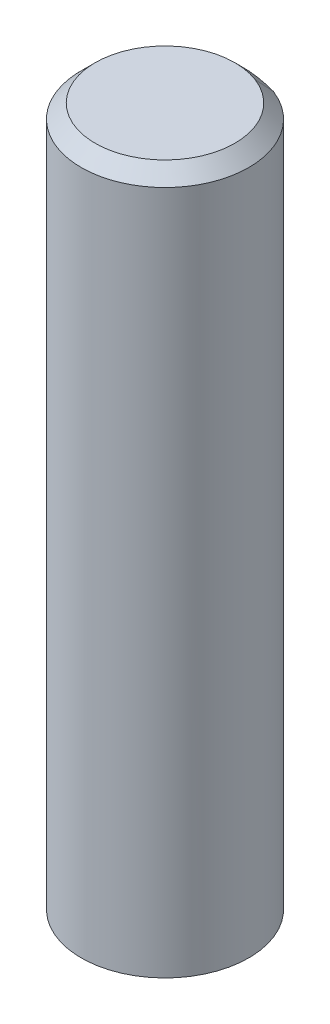
ISO-10303-21;
HEADER;
FILE_DESCRIPTION(('STEP AP214'),'2;1');
FILE_NAME('part.step','',(''),(''),'','','');
FILE_SCHEMA(('AUTOMOTIVE_DESIGN { 1 0 10303 214 1 1 1 1 }'));
ENDSEC;
DATA;
#1=APPLICATION_CONTEXT('core data for automotive mechanical design processes');
#2=APPLICATION_PROTOCOL_DEFINITION('international standard','automotive_design',2000,#1);
#3=PRODUCT_CONTEXT('',#1,'mechanical');
#4=PRODUCT('Part','Part','',(#3));
#5=PRODUCT_RELATED_PRODUCT_CATEGORY('part','',(#4));
#6=PRODUCT_DEFINITION_FORMATION('','',#4);
#7=PRODUCT_DEFINITION_CONTEXT('part definition',#1,'design');
#8=PRODUCT_DEFINITION('design','',#6,#7);
#9=PRODUCT_DEFINITION_SHAPE('','',#8);
#10=(LENGTH_UNIT() NAMED_UNIT(*) SI_UNIT(.MILLI.,.METRE.));
#11=(NAMED_UNIT(*) PLANE_ANGLE_UNIT() SI_UNIT($,.RADIAN.));
#12=(NAMED_UNIT(*) SI_UNIT($,.STERADIAN.) SOLID_ANGLE_UNIT());
#13=UNCERTAINTY_MEASURE_WITH_UNIT(LENGTH_MEASURE(1.E-05),#10,'distance_accuracy_value','');
#14=(GEOMETRIC_REPRESENTATION_CONTEXT(3) GLOBAL_UNCERTAINTY_ASSIGNED_CONTEXT((#13)) GLOBAL_UNIT_ASSIGNED_CONTEXT((#10,
#11,#12)) REPRESENTATION_CONTEXT('',''));
#15=CARTESIAN_POINT('',(0.,0.,0.));
#16=DIRECTION('',(0.,0.,1.));
#17=DIRECTION('',(1.,0.,0.));
#18=AXIS2_PLACEMENT_3D('',#15,#16,#17);
#19=CARTESIAN_POINT('',(0.,25.,0.));
#20=DIRECTION('',(0.,1.,0.));
#21=DIRECTION('',(0.,0.,1.));
#22=AXIS2_PLACEMENT_3D('',#19,#20,#21);
#23=PLANE('',#22);
#24=CARTESIAN_POINT('',(-4.41605694229922E-06,25.0000030573088,-2.31559280090398E-05));
#25=DIRECTION('',(0.,-1.,0.));
#26=DIRECTION('',(0.359014963110202,0.,-0.933331803949153));
#27=AXIS2_PLACEMENT_3D('',#24,#25,#26);
#28=CIRCLE('',#27,2.49999279933527);
#29=CARTESIAN_POINT('',(0.897528860195576,24.9999980865496,-2.33334181521173));
#30=VERTEX_POINT('',#29);
#31=CARTESIAN_POINT('',(-0.897543472307712,24.9999973786579,-2.33333651707424));
#32=VERTEX_POINT('',#31);
#33=EDGE_CURVE('E130',#30,#32,#28,.T.);
#34=ORIENTED_EDGE('',*,*,#33,.F.);
#35=CARTESIAN_POINT('',(3.96266032999439E-06,24.9999918798536,1.41741565208055E-06));
#36=DIRECTION('',(0.,-1.,0.));
#37=DIRECTION('',(-0.359017327837316,0.,-0.933330894330919));
#38=AXIS2_PLACEMENT_3D('',#35,#36,#37);
#39=CIRCLE('',#38,2.500005559707);
#40=EDGE_CURVE('E64',#32,#30,#39,.T.);
#41=ORIENTED_EDGE('',*,*,#40,.F.);
#42=EDGE_LOOP('',(#34,#41));
#43=FACE_BOUND('',#42,.T.);
#44=ADVANCED_FACE('F17',(#43),#23,.T.);
#45=CARTESIAN_POINT('',(3.96266032970383E-06,24.4970054045552,1.41741565208055E-06));
#46=DIRECTION('',(0.,-1.,0.));
#47=DIRECTION('',(1.,0.,0.));
#48=AXIS2_PLACEMENT_3D('',#45,#46,#47);
#49=CONICAL_SURFACE('',#48,3.00299594155375,0.785402046735676);
#50=ORIENTED_EDGE('',*,*,#40,.T.);
#51=CARTESIAN_POINT('',(1.0770315547767,24.5000172652965,-2.80000347708948));
#52=CARTESIAN_POINT('',(1.06955235910355,24.5208500066302,-2.78055940601546));
#53=CARTESIAN_POINT('',(1.06207316107593,24.5416827479638,-2.76111533584708));
#54=CARTESIAN_POINT('',(1.04711476031177,24.5833482306312,-2.72222719732165));
#55=CARTESIAN_POINT('',(1.03963555757523,24.6041809719649,-2.70278312896459));
#56=CARTESIAN_POINT('',(1.02467714739322,24.6458464546322,-2.66389499406179));
#57=CARTESIAN_POINT('',(1.01719793994775,24.6666791959659,-2.64445092751604));
#58=CARTESIAN_POINT('',(1.00223952034789,24.7083446786332,-2.60556279623587));
#59=CARTESIAN_POINT('',(0.994760308193491,24.7291774199669,-2.58611873150144));
#60=CARTESIAN_POINT('',(0.979801879175778,24.7708429026343,-2.54723060384389));
#61=CARTESIAN_POINT('',(0.972322662312459,24.7916756439679,-2.52778654092078));
#62=CARTESIAN_POINT('',(0.957364223876897,24.8333411266353,-2.48889841688587));
#63=CARTESIAN_POINT('',(0.949885002304653,24.854173867969,-2.46945435577407));
#64=CARTESIAN_POINT('',(0.934926554451241,24.8958393506363,-2.43056623536179));
#65=CARTESIAN_POINT('',(0.927447328170073,24.91667209197,-2.41112217606131));
#66=CARTESIAN_POINT('',(0.912488870898813,24.9583375746373,-2.37223405927167));
#67=CARTESIAN_POINT('',(0.905009639908721,24.979170315971,-2.35279000178251));
#68=CARTESIAN_POINT('',(0.897530406564166,25.0000030573047,-2.333345945199));
#69=B_SPLINE_CURVE_WITH_KNOTS('',3,(#51,#52,#53,#54,#55,#56,#57,#58,#59,#60,#61,#62,#63,#64,#65,
#66,#67,#68),.UNSPECIFIED.,.F.,.F.,(4,2,2,2,2,2,2,2,4),(0.,0.0883862003591188,0.176772400718206,
0.265158601077264,0.353544801436293,0.441931001795293,0.530317202154265,0.618703402513211,
0.707089602872129),.UNSPECIFIED.);
#70=CARTESIAN_POINT('',(1.07703017134735,24.5000122522552,-2.799999390986));
#71=VERTEX_POINT('',#70);
#72=EDGE_CURVE('E56',#71,#30,#69,.T.);
#73=ORIENTED_EDGE('',*,*,#72,.F.);
#74=CARTESIAN_POINT('',(-1.07702733909969,24.5000005957629,-2.8));
#75=CARTESIAN_POINT('',(-0.988360501257844,24.5318611098611,-2.8));
#76=CARTESIAN_POINT('',(-0.898499622788504,24.5606732561634,-2.8));
#77=CARTESIAN_POINT('',(-0.716573846856955,24.6110761875861,-2.8));
#78=CARTESIAN_POINT('',(-0.62450449335948,24.6326507749208,-2.8));
#79=CARTESIAN_POINT('',(-0.441821149886365,24.666727653097,-2.8));
#80=CARTESIAN_POINT('',(-0.351260023355029,24.6795068693926,-2.8));
#81=CARTESIAN_POINT('',(-0.169420516874613,24.6963353027654,-2.8));
#82=CARTESIAN_POINT('',(-0.0781430679434558,24.7003944144954,-2.8));
#83=CARTESIAN_POINT('',(0.102256575225958,24.6995507955354,-2.8));
#84=CARTESIAN_POINT('',(0.191379808211524,24.6948530920781,-2.8));
#85=CARTESIAN_POINT('',(0.368887378654103,24.6771876941868,-2.8));
#86=CARTESIAN_POINT('',(0.457270821855495,24.6642111420248,-2.8));
#87=CARTESIAN_POINT('',(0.635502246552053,24.6301639991567,-2.8));
#88=CARTESIAN_POINT('',(0.725300132633011,24.6088368711433,-2.8));
#89=CARTESIAN_POINT('',(0.902782417943566,24.5592986540397,-2.8));
#90=CARTESIAN_POINT('',(0.990470930973961,24.5311024030798,-2.8));
#91=CARTESIAN_POINT('',(1.07702704585084,24.5000035462817,-2.8));
#92=B_SPLINE_CURVE_WITH_KNOTS('',3,(#74,#75,#76,#77,#78,#79,#80,#81,#82,#83,#84,#85,#86,#87,#88,
#89,#90,#91),.UNSPECIFIED.,.F.,.F.,(4,2,2,2,2,2,2,2,4),(0.,0.282737183651158,0.56610298124071,
0.840079369403737,1.11374471355965,1.38108294082369,1.64870768010231,1.9252959942124,
2.20129206102959),.UNSPECIFIED.);
#93=CARTESIAN_POINT('',(-1.07703121602638,24.50001139474,-2.79999990336378));
#94=VERTEX_POINT('',#93);
#95=EDGE_CURVE('E62',#94,#71,#92,.T.);
#96=ORIENTED_EDGE('',*,*,#95,.F.);
#97=CARTESIAN_POINT('',(-0.897545725803441,25.0000040600753,-2.33334237544523));
#98=CARTESIAN_POINT('',(-0.90502450419262,24.9791712923816,-2.35278663527673));
#99=CARTESIAN_POINT('',(-0.912503267190457,24.9583385246881,-2.37223090102829));
#100=CARTESIAN_POINT('',(-0.927460762403527,24.9166729893011,-2.41111944437174));
#101=CARTESIAN_POINT('',(-0.93493949461876,24.8958402216076,-2.43056372196363));
#102=CARTESIAN_POINT('',(-0.949896928266607,24.8541746862205,-2.46945228898769));
#103=CARTESIAN_POINT('',(-0.957375629699221,24.833341918527,-2.48889657841987));
#104=CARTESIAN_POINT('',(-0.972333001781817,24.79167638314,-2.52778516912447));
#105=CARTESIAN_POINT('',(-0.979811672431798,24.7708436154465,-2.54722947039689));
#106=CARTESIAN_POINT('',(-0.994768982949113,24.7291780800594,-2.58611808478196));
#107=CARTESIAN_POINT('',(-1.00224762281645,24.7083453123659,-2.6055623978946));
#108=CARTESIAN_POINT('',(-1.01720487176845,24.6666797769789,-2.64445103596006));
#109=CARTESIAN_POINT('',(-1.02468348085313,24.6458470092854,-2.66389536091288));
#110=CARTESIAN_POINT('',(-1.0396406682398,24.6041814738983,-2.70278402265865));
#111=CARTESIAN_POINT('',(-1.0471192465418,24.5833487062048,-2.72222835945162));
#112=CARTESIAN_POINT('',(-1.0620763723631,24.5416831708178,-2.76111704487764));
#113=CARTESIAN_POINT('',(-1.06955491988241,24.5208504031242,-2.7805613935107));
#114=CARTESIAN_POINT('',(-1.07703345201031,24.5000176354309,-2.80000574806366));
#115=B_SPLINE_CURVE_WITH_KNOTS('',3,(#97,#98,#99,#100,#101,#102,#103,#104,#105,#106,#107,#108,
#109,#110,#111,#112,#113,#114),.UNSPECIFIED.,.F.,.F.,(4,2,2,2,2,2,2,2,4),(0.,0.0883863122168956,
0.176772624434927,0.26515893665412,0.353545248874506,0.441931561096109,0.530317873318958,
0.618704185543081,0.707090497768506),.UNSPECIFIED.);
#116=EDGE_CURVE('E69',#32,#94,#115,.T.);
#117=ORIENTED_EDGE('',*,*,#116,.F.);
#118=EDGE_LOOP('',(#50,#73,#96,#117));
#119=FACE_BOUND('',#118,.T.);
#120=ADVANCED_FACE('F59',(#119),#49,.T.);
#121=CARTESIAN_POINT('',(-4.41605694229922E-06,24.5000172653818,-2.31559280090398E-05));
#122=DIRECTION('',(0.,-1.,0.));
#123=DIRECTION('',(0.,0.,-1.));
#124=AXIS2_PLACEMENT_3D('',#121,#122,#123);
#125=CONICAL_SURFACE('',#124,2.99998271342511,0.785402285660375);
#126=CARTESIAN_POINT('',(1.07703073505263,24.5000200055549,-2.80000085638415));
#127=CARTESIAN_POINT('',(1.14639945044919,24.5000196974915,-2.77331846412729));
#128=CARTESIAN_POINT('',(1.21475231741991,24.500019371081,-2.74406535457629));
#129=CARTESIAN_POINT('',(1.34909168198969,24.5000186832593,-2.68057324593888));
#130=CARTESIAN_POINT('',(1.41507846309053,24.5000183218523,-2.64633484668899));
#131=CARTESIAN_POINT('',(1.60896574453586,24.5000171878311,-2.53639091083137));
#132=CARTESIAN_POINT('',(1.73284381843254,24.5000163651917,-2.45343711961753));
#133=CARTESIAN_POINT('',(1.98268578422548,24.5000144869511,-2.25774541449484));
#134=CARTESIAN_POINT('',(2.10668905785853,24.5000134148981,-2.1425021489527));
#135=CARTESIAN_POINT('',(2.33358896198295,24.5000111538008,-1.89283316629823));
#136=CARTESIAN_POINT('',(2.43648511113052,24.5000099647539,-1.75840701184242));
#137=CARTESIAN_POINT('',(2.61824366239636,24.5000075034855,-1.47419519476923));
#138=CARTESIAN_POINT('',(2.69710744574051,24.5000062312688,-1.32441041552841));
#139=CARTESIAN_POINT('',(2.82857614097165,24.5000036395988,-1.0137129558525));
#140=CARTESIAN_POINT('',(2.88117863184481,24.5000023201411,-0.852799251004332));
#141=CARTESIAN_POINT('',(2.9586197582734,24.4999996715865,-0.524427949855473));
#142=CARTESIAN_POINT('',(2.98345900348802,24.4999983424898,-0.35697049733395));
#143=CARTESIAN_POINT('',(3.00467002678918,24.4999957124236,-0.0202704294164454));
#144=CARTESIAN_POINT('',(3.00104317824884,24.4999944114526,0.148972099463444));
#145=CARTESIAN_POINT('',(2.96542796843656,24.4999918744807,0.484448815708189));
#146=CARTESIAN_POINT('',(2.9334391751144,24.4999906384807,0.650682957205568));
#147=CARTESIAN_POINT('',(2.84200670783689,24.4999882665364,0.975424312660123));
#148=CARTESIAN_POINT('',(2.78256254573618,24.4999871305939,1.13393138917781));
#149=CARTESIAN_POINT('',(2.63790710070614,24.4999849910422,1.43871487721766));
#150=CARTESIAN_POINT('',(2.55269597565034,24.4999839874322,1.58499136366932));
#151=CARTESIAN_POINT('',(2.35892592112377,24.4999821410315,1.86116161365626));
#152=CARTESIAN_POINT('',(2.2503671206833,24.49998129824,1.9910554677234));
#153=CARTESIAN_POINT('',(2.0129828454275,24.4999797973919,2.23077435670855));
#154=CARTESIAN_POINT('',(1.88415732993999,24.4999791393355,2.3405993513505));
#155=CARTESIAN_POINT('',(1.60989654615012,24.499978026639,2.53706274344243));
#156=CARTESIAN_POINT('',(1.46446125272486,24.4999775719991,2.62370110582113));
#157=CARTESIAN_POINT('',(1.16110964656593,24.4999768790427,2.77133155884341));
#158=CARTESIAN_POINT('',(1.00319334113525,24.499976640726,2.83232366449316));
#159=CARTESIAN_POINT('',(0.67936247318965,24.4999763871807,2.92693027431536));
#160=CARTESIAN_POINT('',(0.513447913413095,24.4999763719519,2.96054478786098));
#161=CARTESIAN_POINT('',(0.178330279415576,24.4999765650143,2.99944203527267));
#162=CARTESIAN_POINT('',(0.00912720456567936,24.4999767733056,3.0047247637202));
#163=CARTESIAN_POINT('',(-0.327764243844149,24.4999774074957,2.98680846552921));
#164=CARTESIAN_POINT('',(-0.495452617464928,24.4999778333944,2.96360944003484));
#165=CARTESIAN_POINT('',(-0.824554458917539,24.4999788907095,2.88938819522013));
#166=CARTESIAN_POINT('',(-0.985967927953037,24.4999795221258,2.83836598123692));
#167=CARTESIAN_POINT('',(-1.29793800877541,24.4999809725527,2.70994670571364));
#168=CARTESIAN_POINT('',(-1.44849461596084,24.4999817915633,2.63254963299527));
#169=CARTESIAN_POINT('',(-1.73447710801536,24.4999835939303,2.45357767610425));
#170=CARTESIAN_POINT('',(-1.86990298533246,24.4999845772868,2.35200277986416));
#171=CARTESIAN_POINT('',(-2.12177940312098,24.4999866804293,2.12755877342549));
#172=CARTESIAN_POINT('',(-2.2382299705752,24.4999878002153,2.00468969350765));
#173=CARTESIAN_POINT('',(-2.44885018571715,24.4999901444295,1.74114527462568));
#174=CARTESIAN_POINT('',(-2.54301986142572,24.4999913688576,1.60046995805532));
#175=CARTESIAN_POINT('',(-2.70640561277005,24.499993887605,1.30530570273905));
#176=CARTESIAN_POINT('',(-2.77562159015398,24.4999951819246,1.15081670960664));
#177=CARTESIAN_POINT('',(-2.88713469798363,24.499997803711,0.832410766291706));
#178=CARTESIAN_POINT('',(-2.92943177496895,24.499999131178,0.668493797386111));
#179=CARTESIAN_POINT('',(-2.98590590978311,24.5000017815633,0.335886646148389));
#180=CARTESIAN_POINT('',(-3.00008319001585,24.5000031044817,0.167196501578763));
#181=CARTESIAN_POINT('',(-2.99991607307604,24.5000057082311,-0.170170202700393));
#182=CARTESIAN_POINT('',(-2.98557157554522,24.500006989062,-0.338846762360034));
#183=CARTESIAN_POINT('',(-2.92876742623541,24.5000094722746,-0.671397847630818));
#184=CARTESIAN_POINT('',(-2.8863077499415,24.5000106746562,-0.835272369054713));
#185=CARTESIAN_POINT('',(-2.77448312927695,24.5000129667722,-1.15355809673407));
#186=CARTESIAN_POINT('',(-2.70511959601595,24.5000140565125,-1.30796979882343));
#187=CARTESIAN_POINT('',(-2.54144130495885,24.5000160926069,-1.6029748436524));
#188=CARTESIAN_POINT('',(-2.44712395250037,24.5000170389461,-1.74356674734299));
#189=CARTESIAN_POINT('',(-2.23620799602398,24.5000187614579,-2.00695346621601));
#190=CARTESIAN_POINT('',(-2.11960226299694,24.5000195375758,-2.12974256495704));
#191=CARTESIAN_POINT('',(-1.86744997043767,24.5000208969052,-2.35394058119845));
#192=CARTESIAN_POINT('',(-1.73191757796114,24.5000214802598,-2.45536534926887));
#193=CARTESIAN_POINT('',(-1.5078730305568,24.5000222304248,-2.5952815991631));
#194=CARTESIAN_POINT('',(-1.42439349548206,24.5000224682495,-2.64201369226755));
#195=CARTESIAN_POINT('',(-1.25350863628205,24.5000228745026,-2.72723580877453));
#196=CARTESIAN_POINT('',(-1.1661103465572,24.5000230430501,-2.76573993755593));
#197=CARTESIAN_POINT('',(-1.07703147338454,24.5000231763699,-2.80000057238193));
#198=B_SPLINE_CURVE_WITH_KNOTS('',3,(#126,#127,#128,#129,#130,#131,#132,#133,#134,#135,#136,
#137,#138,#139,#140,#141,#142,#143,#144,#145,#146,#147,#148,#149,#150,#151,#152,#153,#154,#155,
#156,#157,#158,#159,#160,#161,#162,#163,#164,#165,#166,#167,#168,#169,#170,#171,#172,#173,#174,
#175,#176,#177,#178,#179,#180,#181,#182,#183,#184,#185,#186,#187,#188,#189,#190,#191,#192,#193,
#194,#195,#196,#197),.UNSPECIFIED.,.F.,.F.,(4,2,2,2,2,2,2,2,2,2,2,2,2,2,2,2,2,2,2,2,2,2,2,2,2,2,
2,2,2,2,2,2,2,2,2,4),(0.,0.222868739289624,0.445710684848957,0.891233408253707,1.39668144036571,
1.90214099783921,2.40757149926559,2.91304858744602,3.41851457552618,3.92395617708004,
4.42940547838448,4.93486376671923,5.44031895818697,5.94577135634232,6.4512247688759,
6.95667894593649,7.4621328272445,7.96758653550186,8.47304034042881,8.97849412505115,
9.48394781271579,9.98940171460417,10.4948558687715,11.0003093041791,11.5057621039163,
12.0112168937844,12.5166726874726,13.0221244834153,13.5275780578713,14.033032073056,
14.538459580718,15.0439396626763,15.5495816954116,16.0548472517791,16.341465398886,
16.6275881767715),.UNSPECIFIED.);
#199=EDGE_CURVE('E73',#71,#94,#198,.T.);
#200=ORIENTED_EDGE('',*,*,#199,.F.);
#201=ORIENTED_EDGE('',*,*,#72,.T.);
#202=ORIENTED_EDGE('',*,*,#33,.T.);
#203=ORIENTED_EDGE('',*,*,#116,.T.);
#204=EDGE_LOOP('',(#200,#201,#202,#203));
#205=FACE_BOUND('',#204,.T.);
#206=ADVANCED_FACE('F74',(#205),#125,.T.);
#207=CARTESIAN_POINT('',(0.,0.,0.));
#208=DIRECTION('',(0.,1.,0.));
#209=DIRECTION('',(0.,0.,1.));
#210=AXIS2_PLACEMENT_3D('',#207,#208,#209);
#211=PLANE('',#210);
#212=DIRECTION('',(-1.,0.,0.));
#213=VECTOR('',#212,1.);
#214=CARTESIAN_POINT('',(1.0770329614269,0.,-2.8));
#215=LINE('',#214,#213);
#216=CARTESIAN_POINT('',(1.0770329614269,0.,-2.8));
#217=VERTEX_POINT('',#216);
#218=CARTESIAN_POINT('',(-1.07703221207887,0.,-2.80000028823996));
#219=VERTEX_POINT('',#218);
#220=EDGE_CURVE('E37',#217,#219,#215,.T.);
#221=ORIENTED_EDGE('',*,*,#220,.F.);
#222=CARTESIAN_POINT('',(0.,0.,0.));
#223=DIRECTION('',(0.,1.,0.));
#224=DIRECTION('',(0.,0.,1.));
#225=AXIS2_PLACEMENT_3D('',#222,#223,#224);
#226=CIRCLE('',#225,3.);
#227=EDGE_CURVE('E30',#219,#217,#226,.T.);
#228=ORIENTED_EDGE('',*,*,#227,.F.);
#229=EDGE_LOOP('',(#221,#228));
#230=FACE_BOUND('',#229,.T.);
#231=ADVANCED_FACE('F99',(#230),#211,.F.);
#232=CARTESIAN_POINT('',(1.0770329614269,0.,-2.8));
#233=DIRECTION('',(0.,0.,-1.));
#234=DIRECTION('',(-1.,0.,0.));
#235=AXIS2_PLACEMENT_3D('',#232,#233,#234);
#236=PLANE('',#235);
#237=ORIENTED_EDGE('',*,*,#220,.T.);
#238=DIRECTION('',(0.,1.,0.));
#239=VECTOR('',#238,1.);
#240=CARTESIAN_POINT('',(-1.07703146273084,0.,-2.80000057647992));
#241=LINE('',#240,#239);
#242=EDGE_CURVE('E78',#94,#219,#241,.F.);
#243=ORIENTED_EDGE('',*,*,#242,.F.);
#244=ORIENTED_EDGE('',*,*,#95,.T.);
#245=DIRECTION('',(0.,1.,0.));
#246=VECTOR('',#245,1.);
#247=CARTESIAN_POINT('',(1.0770329614269,0.,-2.8));
#248=LINE('',#247,#246);
#249=EDGE_CURVE('E11',#217,#71,#248,.T.);
#250=ORIENTED_EDGE('',*,*,#249,.F.);
#251=EDGE_LOOP('',(#237,#243,#244,#250));
#252=FACE_BOUND('',#251,.T.);
#253=ADVANCED_FACE('F80',(#252),#236,.T.);
#254=CARTESIAN_POINT('',(0.,0.,0.));
#255=DIRECTION('',(0.,1.,0.));
#256=DIRECTION('',(0.,0.,1.));
#257=AXIS2_PLACEMENT_3D('',#254,#255,#256);
#258=CYLINDRICAL_SURFACE('',#257,3.);
#259=ORIENTED_EDGE('',*,*,#227,.T.);
#260=ORIENTED_EDGE('',*,*,#249,.T.);
#261=ORIENTED_EDGE('',*,*,#199,.T.);
#262=ORIENTED_EDGE('',*,*,#242,.T.);
#263=EDGE_LOOP('',(#259,#260,#261,#262));
#264=FACE_BOUND('',#263,.T.);
#265=ADVANCED_FACE('F82',(#264),#258,.T.);
#266=CLOSED_SHELL('',(#44,#120,#206,#231,#253,#265));
#267=MANIFOLD_SOLID_BREP('B1',#266);
#268=ADVANCED_BREP_SHAPE_REPRESENTATION('',(#18,#267),#14);
#269=SHAPE_DEFINITION_REPRESENTATION(#9,#268);
ENDSEC;
END-ISO-10303-21;
